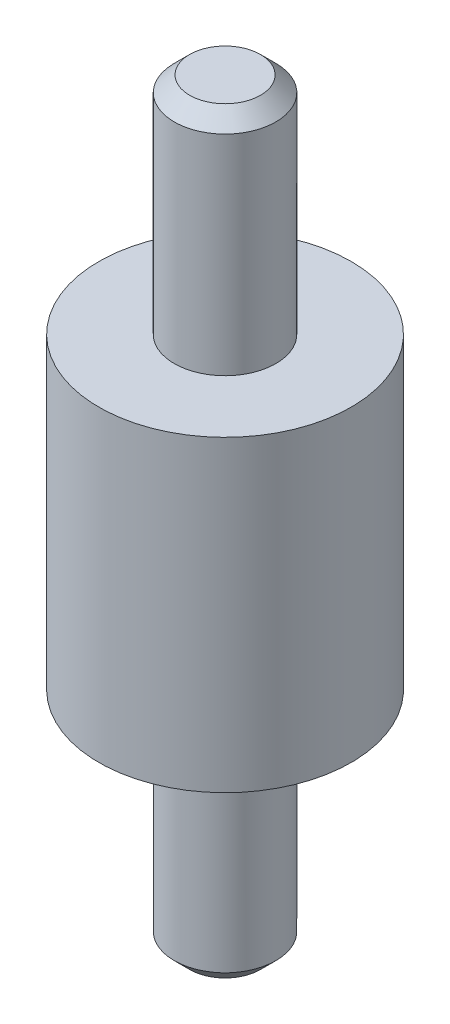
ISO-10303-21;
HEADER;
FILE_DESCRIPTION(('STEP AP214'),'2;1');
FILE_NAME('part.step','',(''),(''),'','','');
FILE_SCHEMA(('AUTOMOTIVE_DESIGN { 1 0 10303 214 1 1 1 1 }'));
ENDSEC;
DATA;
#1=APPLICATION_CONTEXT('core data for automotive mechanical design processes');
#2=APPLICATION_PROTOCOL_DEFINITION('international standard','automotive_design',2000,#1);
#3=PRODUCT_CONTEXT('',#1,'mechanical');
#4=PRODUCT('Part','Part','',(#3));
#5=PRODUCT_RELATED_PRODUCT_CATEGORY('part','',(#4));
#6=PRODUCT_DEFINITION_FORMATION('','',#4);
#7=PRODUCT_DEFINITION_CONTEXT('part definition',#1,'design');
#8=PRODUCT_DEFINITION('design','',#6,#7);
#9=PRODUCT_DEFINITION_SHAPE('','',#8);
#10=(LENGTH_UNIT() NAMED_UNIT(*) SI_UNIT(.MILLI.,.METRE.));
#11=(NAMED_UNIT(*) PLANE_ANGLE_UNIT() SI_UNIT($,.RADIAN.));
#12=(NAMED_UNIT(*) SI_UNIT($,.STERADIAN.) SOLID_ANGLE_UNIT());
#13=UNCERTAINTY_MEASURE_WITH_UNIT(LENGTH_MEASURE(1.E-05),#10,'distance_accuracy_value','');
#14=(GEOMETRIC_REPRESENTATION_CONTEXT(3) GLOBAL_UNCERTAINTY_ASSIGNED_CONTEXT((#13)) GLOBAL_UNIT_ASSIGNED_CONTEXT((#10,
#11,#12)) REPRESENTATION_CONTEXT('',''));
#15=CARTESIAN_POINT('',(0.,0.,0.));
#16=DIRECTION('',(0.,0.,1.));
#17=DIRECTION('',(1.,0.,0.));
#18=AXIS2_PLACEMENT_3D('',#15,#16,#17);
#19=CARTESIAN_POINT('',(0.,15.621,0.));
#20=DIRECTION('',(0.,1.,0.));
#21=DIRECTION('',(0.,0.,1.));
#22=AXIS2_PLACEMENT_3D('',#19,#20,#21);
#23=PLANE('',#22);
#24=CARTESIAN_POINT('',(0.,15.6210000000669,0.));
#25=DIRECTION('',(0.,-1.,0.));
#26=DIRECTION('',(0.,0.,-1.));
#27=AXIS2_PLACEMENT_3D('',#24,#25,#26);
#28=CIRCLE('',#27,1.46050000000741);
#29=CARTESIAN_POINT('',(0.,15.6210000000669,-1.46050000000741));
#30=VERTEX_POINT('',#29);
#31=EDGE_CURVE('E17',#30,#30,#28,.T.);
#32=ORIENTED_EDGE('',*,*,#31,.F.);
#33=EDGE_LOOP('',(#32));
#34=FACE_BOUND('',#33,.T.);
#35=ADVANCED_FACE('F14',(#34),#23,.T.);
#36=CARTESIAN_POINT('',(0.,-15.621,0.));
#37=DIRECTION('',(0.,1.,0.));
#38=DIRECTION('',(0.,0.,1.));
#39=AXIS2_PLACEMENT_3D('',#36,#37,#38);
#40=PLANE('',#39);
#41=CARTESIAN_POINT('',(0.,-15.6210000000101,0.));
#42=DIRECTION('',(0.,1.,0.));
#43=DIRECTION('',(0.,0.,1.));
#44=AXIS2_PLACEMENT_3D('',#41,#42,#43);
#45=CIRCLE('',#44,1.46050000006426);
#46=CARTESIAN_POINT('',(0.,-15.6210000000101,1.46050000006426));
#47=VERTEX_POINT('',#46);
#48=EDGE_CURVE('E37',#47,#47,#45,.T.);
#49=ORIENTED_EDGE('',*,*,#48,.F.);
#50=EDGE_LOOP('',(#49));
#51=FACE_BOUND('',#50,.T.);
#52=ADVANCED_FACE('F49',(#51),#40,.F.);
#53=CARTESIAN_POINT('',(0.,14.9860000000217,0.));
#54=DIRECTION('',(0.,-1.,0.));
#55=DIRECTION('',(0.,0.,-1.));
#56=AXIS2_PLACEMENT_3D('',#53,#54,#55);
#57=CONICAL_SURFACE('',#56,2.09550000005265,0.785398163397448);
#58=ORIENTED_EDGE('',*,*,#31,.T.);
#59=EDGE_LOOP('',(#58));
#60=FACE_BOUND('',#59,.T.);
#61=CARTESIAN_POINT('',(0.,14.986,0.));
#62=DIRECTION('',(0.,-1.,0.));
#63=DIRECTION('',(0.,0.,-1.));
#64=AXIS2_PLACEMENT_3D('',#61,#62,#63);
#65=CIRCLE('',#64,2.0955);
#66=CARTESIAN_POINT('',(0.,14.986,-2.0955));
#67=VERTEX_POINT('',#66);
#68=EDGE_CURVE('E29',#67,#67,#65,.T.);
#69=ORIENTED_EDGE('',*,*,#68,.F.);
#70=EDGE_LOOP('',(#69));
#71=FACE_BOUND('',#70,.T.);
#72=ADVANCED_FACE('F45',(#60,#71),#57,.T.);
#73=CARTESIAN_POINT('',(0.,-14.9860000000217,0.));
#74=DIRECTION('',(0.,1.,0.));
#75=DIRECTION('',(0.,0.,1.));
#76=AXIS2_PLACEMENT_3D('',#73,#74,#75);
#77=CONICAL_SURFACE('',#76,2.09549999999581,0.78539816335269);
#78=CARTESIAN_POINT('',(0.,-14.986,0.));
#79=DIRECTION('',(0.,-1.,0.));
#80=DIRECTION('',(0.,0.,-1.));
#81=AXIS2_PLACEMENT_3D('',#78,#79,#80);
#82=CIRCLE('',#81,2.0955);
#83=CARTESIAN_POINT('',(0.,-14.986,-2.0955));
#84=VERTEX_POINT('',#83);
#85=EDGE_CURVE('E36',#84,#84,#82,.F.);
#86=ORIENTED_EDGE('',*,*,#85,.F.);
#87=EDGE_LOOP('',(#86));
#88=FACE_BOUND('',#87,.T.);
#89=ORIENTED_EDGE('',*,*,#48,.T.);
#90=EDGE_LOOP('',(#89));
#91=FACE_BOUND('',#90,.T.);
#92=ADVANCED_FACE('F77',(#88,#91),#77,.T.);
#93=CARTESIAN_POINT('',(0.,15.621,0.));
#94=DIRECTION('',(0.,-1.,0.));
#95=DIRECTION('',(0.,0.,-1.));
#96=AXIS2_PLACEMENT_3D('',#93,#94,#95);
#97=CYLINDRICAL_SURFACE('',#96,2.0955);
#98=ORIENTED_EDGE('',*,*,#68,.T.);
#99=EDGE_LOOP('',(#98));
#100=FACE_BOUND('',#99,.T.);
#101=CARTESIAN_POINT('',(0.,6.35,0.));
#102=DIRECTION('',(0.,-1.,0.));
#103=DIRECTION('',(0.,0.,-1.));
#104=AXIS2_PLACEMENT_3D('',#101,#102,#103);
#105=CIRCLE('',#104,2.0955);
#106=CARTESIAN_POINT('',(0.,6.35,-2.0955));
#107=VERTEX_POINT('',#106);
#108=EDGE_CURVE('E34',#107,#107,#105,.T.);
#109=ORIENTED_EDGE('',*,*,#108,.F.);
#110=EDGE_LOOP('',(#109));
#111=FACE_BOUND('',#110,.T.);
#112=ADVANCED_FACE('F73',(#100,#111),#97,.T.);
#113=CARTESIAN_POINT('',(0.,15.621,0.));
#114=DIRECTION('',(0.,-1.,0.));
#115=DIRECTION('',(0.,0.,-1.));
#116=AXIS2_PLACEMENT_3D('',#113,#114,#115);
#117=CYLINDRICAL_SURFACE('',#116,2.0955);
#118=ORIENTED_EDGE('',*,*,#85,.T.);
#119=EDGE_LOOP('',(#118));
#120=FACE_BOUND('',#119,.T.);
#121=CARTESIAN_POINT('',(0.,-6.35,0.));
#122=DIRECTION('',(0.,-1.,0.));
#123=DIRECTION('',(0.,0.,-1.));
#124=AXIS2_PLACEMENT_3D('',#121,#122,#123);
#125=CIRCLE('',#124,2.0955);
#126=CARTESIAN_POINT('',(0.,-6.35,-2.0955));
#127=VERTEX_POINT('',#126);
#128=EDGE_CURVE('E26',#127,#127,#125,.T.);
#129=ORIENTED_EDGE('',*,*,#128,.T.);
#130=EDGE_LOOP('',(#129));
#131=FACE_BOUND('',#130,.T.);
#132=ADVANCED_FACE('F69',(#120,#131),#117,.T.);
#133=CARTESIAN_POINT('',(0.,6.35,0.));
#134=DIRECTION('',(0.,1.,0.));
#135=DIRECTION('',(0.,0.,1.));
#136=AXIS2_PLACEMENT_3D('',#133,#134,#135);
#137=PLANE('',#136);
#138=ORIENTED_EDGE('',*,*,#108,.T.);
#139=EDGE_LOOP('',(#138));
#140=FACE_BOUND('',#139,.T.);
#141=CARTESIAN_POINT('',(0.,6.35,0.));
#142=DIRECTION('',(0.,-1.,0.));
#143=DIRECTION('',(0.,0.,-1.));
#144=AXIS2_PLACEMENT_3D('',#141,#142,#143);
#145=CIRCLE('',#144,5.207);
#146=CARTESIAN_POINT('',(0.,6.35,-5.207));
#147=VERTEX_POINT('',#146);
#148=EDGE_CURVE('E21',#147,#147,#145,.T.);
#149=ORIENTED_EDGE('',*,*,#148,.F.);
#150=EDGE_LOOP('',(#149));
#151=FACE_BOUND('',#150,.T.);
#152=ADVANCED_FACE('F62',(#140,#151),#137,.T.);
#153=CARTESIAN_POINT('',(0.,-6.35,0.));
#154=DIRECTION('',(0.,1.,0.));
#155=DIRECTION('',(0.,0.,1.));
#156=AXIS2_PLACEMENT_3D('',#153,#154,#155);
#157=PLANE('',#156);
#158=ORIENTED_EDGE('',*,*,#128,.F.);
#159=EDGE_LOOP('',(#158));
#160=FACE_BOUND('',#159,.T.);
#161=CARTESIAN_POINT('',(0.,-6.35,0.));
#162=DIRECTION('',(0.,-1.,0.));
#163=DIRECTION('',(0.,0.,-1.));
#164=AXIS2_PLACEMENT_3D('',#161,#162,#163);
#165=CIRCLE('',#164,5.207);
#166=CARTESIAN_POINT('',(0.,-6.35,-5.207));
#167=VERTEX_POINT('',#166);
#168=EDGE_CURVE('E9',#167,#167,#165,.F.);
#169=ORIENTED_EDGE('',*,*,#168,.F.);
#170=EDGE_LOOP('',(#169));
#171=FACE_BOUND('',#170,.T.);
#172=ADVANCED_FACE('F57',(#160,#171),#157,.F.);
#173=CARTESIAN_POINT('',(0.,6.35,0.));
#174=DIRECTION('',(0.,-1.,0.));
#175=DIRECTION('',(0.,0.,-1.));
#176=AXIS2_PLACEMENT_3D('',#173,#174,#175);
#177=CYLINDRICAL_SURFACE('',#176,5.207);
#178=ORIENTED_EDGE('',*,*,#168,.T.);
#179=EDGE_LOOP('',(#178));
#180=FACE_BOUND('',#179,.T.);
#181=ORIENTED_EDGE('',*,*,#148,.T.);
#182=EDGE_LOOP('',(#181));
#183=FACE_BOUND('',#182,.T.);
#184=ADVANCED_FACE('F55',(#180,#183),#177,.T.);
#185=CLOSED_SHELL('',(#35,#52,#72,#92,#112,#132,#152,#172,#184));
#186=MANIFOLD_SOLID_BREP('B1',#185);
#187=ADVANCED_BREP_SHAPE_REPRESENTATION('',(#18,#186),#14);
#188=SHAPE_DEFINITION_REPRESENTATION(#9,#187);
ENDSEC;
END-ISO-10303-21;
